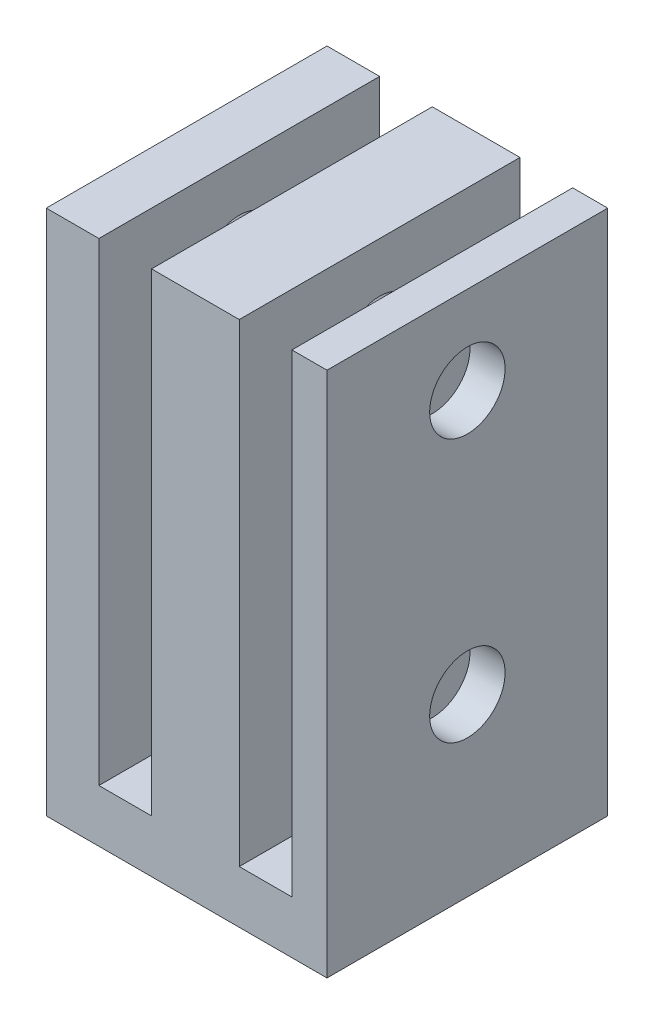
ISO-10303-21;
HEADER;
FILE_DESCRIPTION(('STEP AP214'),'2;1');
FILE_NAME('part.step','',(''),(''),'','','');
FILE_SCHEMA(('AUTOMOTIVE_DESIGN { 1 0 10303 214 1 1 1 1 }'));
ENDSEC;
DATA;
#1=APPLICATION_CONTEXT('core data for automotive mechanical design processes');
#2=APPLICATION_PROTOCOL_DEFINITION('international standard','automotive_design',2000,#1);
#3=PRODUCT_CONTEXT('',#1,'mechanical');
#4=PRODUCT('Part','Part','',(#3));
#5=PRODUCT_RELATED_PRODUCT_CATEGORY('part','',(#4));
#6=PRODUCT_DEFINITION_FORMATION('','',#4);
#7=PRODUCT_DEFINITION_CONTEXT('part definition',#1,'design');
#8=PRODUCT_DEFINITION('design','',#6,#7);
#9=PRODUCT_DEFINITION_SHAPE('','',#8);
#10=(LENGTH_UNIT() NAMED_UNIT(*) SI_UNIT(.MILLI.,.METRE.));
#11=(NAMED_UNIT(*) PLANE_ANGLE_UNIT() SI_UNIT($,.RADIAN.));
#12=(NAMED_UNIT(*) SI_UNIT($,.STERADIAN.) SOLID_ANGLE_UNIT());
#13=UNCERTAINTY_MEASURE_WITH_UNIT(LENGTH_MEASURE(1.E-05),#10,'distance_accuracy_value','');
#14=(GEOMETRIC_REPRESENTATION_CONTEXT(3) GLOBAL_UNCERTAINTY_ASSIGNED_CONTEXT((#13)) GLOBAL_UNIT_ASSIGNED_CONTEXT((#10,
#11,#12)) REPRESENTATION_CONTEXT('',''));
#15=CARTESIAN_POINT('',(0.,0.,0.));
#16=DIRECTION('',(0.,0.,1.));
#17=DIRECTION('',(1.,0.,0.));
#18=AXIS2_PLACEMENT_3D('',#15,#16,#17);
#19=CARTESIAN_POINT('',(0.,30.,0.));
#20=DIRECTION('',(0.,-1.,0.));
#21=DIRECTION('',(0.,0.,-1.));
#22=AXIS2_PLACEMENT_3D('',#19,#20,#21);
#23=PLANE('',#22);
#24=DIRECTION('',(1.,0.,0.));
#25=VECTOR('',#24,1.);
#26=CARTESIAN_POINT('',(0.,30.,0.));
#27=LINE('',#26,#25);
#28=CARTESIAN_POINT('',(0.,30.,0.));
#29=VERTEX_POINT('',#28);
#30=CARTESIAN_POINT('',(3.,30.,0.));
#31=VERTEX_POINT('',#30);
#32=EDGE_CURVE('E195',#29,#31,#27,.T.);
#33=ORIENTED_EDGE('',*,*,#32,.T.);
#34=DIRECTION('',(0.,0.,1.));
#35=VECTOR('',#34,1.);
#36=CARTESIAN_POINT('',(3.,30.,-16.));
#37=LINE('',#36,#35);
#38=CARTESIAN_POINT('',(3.,30.,-16.));
#39=VERTEX_POINT('',#38);
#40=EDGE_CURVE('E161',#39,#31,#37,.T.);
#41=ORIENTED_EDGE('',*,*,#40,.F.);
#42=DIRECTION('',(-1.,0.,0.));
#43=VECTOR('',#42,1.);
#44=CARTESIAN_POINT('',(0.,30.,-16.));
#45=LINE('',#44,#43);
#46=CARTESIAN_POINT('',(0.,30.,-16.));
#47=VERTEX_POINT('',#46);
#48=EDGE_CURVE('E149',#39,#47,#45,.T.);
#49=ORIENTED_EDGE('',*,*,#48,.T.);
#50=DIRECTION('',(0.,0.,1.));
#51=VECTOR('',#50,1.);
#52=CARTESIAN_POINT('',(0.,30.,0.));
#53=LINE('',#52,#51);
#54=EDGE_CURVE('E190',#47,#29,#53,.T.);
#55=ORIENTED_EDGE('',*,*,#54,.T.);
#56=EDGE_LOOP('',(#33,#41,#49,#55));
#57=FACE_BOUND('',#56,.T.);
#58=ADVANCED_FACE('F35',(#57),#23,.F.);
#59=CARTESIAN_POINT('',(11.,30.,-16.));
#60=VERTEX_POINT('',#59);
#61=CARTESIAN_POINT('',(6.,30.,-16.));
#62=VERTEX_POINT('',#61);
#63=EDGE_CURVE('E205',#60,#62,#45,.T.);
#64=ORIENTED_EDGE('',*,*,#63,.T.);
#65=DIRECTION('',(0.,0.,1.));
#66=VECTOR('',#65,1.);
#67=CARTESIAN_POINT('',(6.,30.,-16.));
#68=LINE('',#67,#66);
#69=CARTESIAN_POINT('',(6.,30.,0.));
#70=VERTEX_POINT('',#69);
#71=EDGE_CURVE('E164',#62,#70,#68,.T.);
#72=ORIENTED_EDGE('',*,*,#71,.T.);
#73=CARTESIAN_POINT('',(11.,30.,0.));
#74=VERTEX_POINT('',#73);
#75=EDGE_CURVE('E199',#70,#74,#27,.T.);
#76=ORIENTED_EDGE('',*,*,#75,.T.);
#77=DIRECTION('',(0.,0.,1.));
#78=VECTOR('',#77,1.);
#79=CARTESIAN_POINT('',(11.,30.,-16.));
#80=LINE('',#79,#78);
#81=EDGE_CURVE('E159',#60,#74,#80,.T.);
#82=ORIENTED_EDGE('',*,*,#81,.F.);
#83=EDGE_LOOP('',(#64,#72,#76,#82));
#84=FACE_BOUND('',#83,.T.);
#85=ADVANCED_FACE('F281',(#84),#23,.F.);
#86=CARTESIAN_POINT('',(0.,30.,0.));
#87=DIRECTION('',(1.,0.,0.));
#88=DIRECTION('',(0.,0.,-1.));
#89=AXIS2_PLACEMENT_3D('',#86,#87,#88);
#90=PLANE('',#89);
#91=CARTESIAN_POINT('',(0.,25.,-8.));
#92=DIRECTION('',(-1.,0.,0.));
#93=DIRECTION('',(0.,0.,1.));
#94=AXIS2_PLACEMENT_3D('',#91,#92,#93);
#95=CIRCLE('',#94,2.15);
#96=CARTESIAN_POINT('',(0.,25.,-5.85));
#97=VERTEX_POINT('',#96);
#98=EDGE_CURVE('E229',#97,#97,#95,.T.);
#99=ORIENTED_EDGE('',*,*,#98,.F.);
#100=EDGE_LOOP('',(#99));
#101=FACE_BOUND('',#100,.T.);
#102=CARTESIAN_POINT('',(0.,10.,-8.));
#103=DIRECTION('',(-1.,0.,0.));
#104=DIRECTION('',(0.,0.,1.));
#105=AXIS2_PLACEMENT_3D('',#102,#103,#104);
#106=CIRCLE('',#105,2.15);
#107=CARTESIAN_POINT('',(0.,10.,-5.85));
#108=VERTEX_POINT('',#107);
#109=EDGE_CURVE('E239',#108,#108,#106,.T.);
#110=ORIENTED_EDGE('',*,*,#109,.F.);
#111=EDGE_LOOP('',(#110));
#112=FACE_BOUND('',#111,.T.);
#113=DIRECTION('',(0.,0.,1.));
#114=VECTOR('',#113,1.);
#115=CARTESIAN_POINT('',(0.,0.,0.));
#116=LINE('',#115,#114);
#117=CARTESIAN_POINT('',(0.,0.,-16.));
#118=VERTEX_POINT('',#117);
#119=CARTESIAN_POINT('',(0.,0.,0.));
#120=VERTEX_POINT('',#119);
#121=EDGE_CURVE('E163',#118,#120,#116,.T.);
#122=ORIENTED_EDGE('',*,*,#121,.T.);
#123=DIRECTION('',(0.,-1.,0.));
#124=VECTOR('',#123,1.);
#125=CARTESIAN_POINT('',(0.,30.,0.));
#126=LINE('',#125,#124);
#127=EDGE_CURVE('E11',#29,#120,#126,.T.);
#128=ORIENTED_EDGE('',*,*,#127,.F.);
#129=ORIENTED_EDGE('',*,*,#54,.F.);
#130=DIRECTION('',(0.,-1.,0.));
#131=VECTOR('',#130,1.);
#132=CARTESIAN_POINT('',(0.,30.,-16.));
#133=LINE('',#132,#131);
#134=EDGE_CURVE('E204',#47,#118,#133,.T.);
#135=ORIENTED_EDGE('',*,*,#134,.T.);
#136=EDGE_LOOP('',(#122,#128,#129,#135));
#137=FACE_BOUND('',#136,.T.);
#138=ADVANCED_FACE('F37',(#101,#112,#137),#90,.F.);
#139=CARTESIAN_POINT('',(0.,30.,0.));
#140=DIRECTION('',(0.,0.,-1.));
#141=DIRECTION('',(-1.,0.,0.));
#142=AXIS2_PLACEMENT_3D('',#139,#140,#141);
#143=PLANE('',#142);
#144=DIRECTION('',(1.,0.,0.));
#145=VECTOR('',#144,1.);
#146=CARTESIAN_POINT('',(3.,3.,0.));
#147=LINE('',#146,#145);
#148=CARTESIAN_POINT('',(3.,3.,0.));
#149=VERTEX_POINT('',#148);
#150=CARTESIAN_POINT('',(6.,3.,0.));
#151=VERTEX_POINT('',#150);
#152=EDGE_CURVE('E151',#149,#151,#147,.T.);
#153=ORIENTED_EDGE('',*,*,#152,.F.);
#154=DIRECTION('',(0.,-1.,0.));
#155=VECTOR('',#154,1.);
#156=CARTESIAN_POINT('',(3.,30.,0.));
#157=LINE('',#156,#155);
#158=EDGE_CURVE('E132',#31,#149,#157,.T.);
#159=ORIENTED_EDGE('',*,*,#158,.F.);
#160=ORIENTED_EDGE('',*,*,#32,.F.);
#161=ORIENTED_EDGE('',*,*,#127,.T.);
#162=DIRECTION('',(1.,0.,0.));
#163=VECTOR('',#162,1.);
#164=CARTESIAN_POINT('',(0.,0.,0.));
#165=LINE('',#164,#163);
#166=CARTESIAN_POINT('',(16.,0.,0.));
#167=VERTEX_POINT('',#166);
#168=EDGE_CURVE('E208',#120,#167,#165,.T.);
#169=ORIENTED_EDGE('',*,*,#168,.T.);
#170=DIRECTION('',(0.,-1.,0.));
#171=VECTOR('',#170,1.);
#172=CARTESIAN_POINT('',(16.,30.,0.));
#173=LINE('',#172,#171);
#174=CARTESIAN_POINT('',(16.,30.,0.));
#175=VERTEX_POINT('',#174);
#176=EDGE_CURVE('E44',#175,#167,#173,.T.);
#177=ORIENTED_EDGE('',*,*,#176,.F.);
#178=CARTESIAN_POINT('',(14.,30.,0.));
#179=VERTEX_POINT('',#178);
#180=EDGE_CURVE('E193',#179,#175,#27,.T.);
#181=ORIENTED_EDGE('',*,*,#180,.F.);
#182=DIRECTION('',(0.,1.,0.));
#183=VECTOR('',#182,1.);
#184=CARTESIAN_POINT('',(14.,30.,0.));
#185=LINE('',#184,#183);
#186=CARTESIAN_POINT('',(14.,3.,0.));
#187=VERTEX_POINT('',#186);
#188=EDGE_CURVE('E52',#187,#179,#185,.T.);
#189=ORIENTED_EDGE('',*,*,#188,.F.);
#190=DIRECTION('',(1.,0.,0.));
#191=VECTOR('',#190,1.);
#192=CARTESIAN_POINT('',(11.,3.,0.));
#193=LINE('',#192,#191);
#194=CARTESIAN_POINT('',(11.,3.,0.));
#195=VERTEX_POINT('',#194);
#196=EDGE_CURVE('E180',#195,#187,#193,.T.);
#197=ORIENTED_EDGE('',*,*,#196,.F.);
#198=DIRECTION('',(0.,-1.,0.));
#199=VECTOR('',#198,1.);
#200=CARTESIAN_POINT('',(11.,30.,0.));
#201=LINE('',#200,#199);
#202=EDGE_CURVE('E177',#74,#195,#201,.T.);
#203=ORIENTED_EDGE('',*,*,#202,.F.);
#204=ORIENTED_EDGE('',*,*,#75,.F.);
#205=DIRECTION('',(0.,1.,0.));
#206=VECTOR('',#205,1.);
#207=CARTESIAN_POINT('',(6.,30.,0.));
#208=LINE('',#207,#206);
#209=EDGE_CURVE('E60',#151,#70,#208,.T.);
#210=ORIENTED_EDGE('',*,*,#209,.F.);
#211=EDGE_LOOP('',(#153,#159,#160,#161,#169,#177,#181,#189,#197,#203,#204,#210));
#212=FACE_BOUND('',#211,.T.);
#213=ADVANCED_FACE('F314',(#212),#143,.F.);
#214=CARTESIAN_POINT('',(16.,30.,0.));
#215=DIRECTION('',(-1.,0.,0.));
#216=DIRECTION('',(0.,0.,1.));
#217=AXIS2_PLACEMENT_3D('',#214,#215,#216);
#218=PLANE('',#217);
#219=CARTESIAN_POINT('',(16.,25.,-8.));
#220=DIRECTION('',(-1.,0.,0.));
#221=DIRECTION('',(0.,0.,1.));
#222=AXIS2_PLACEMENT_3D('',#219,#220,#221);
#223=CIRCLE('',#222,2.15);
#224=CARTESIAN_POINT('',(16.,25.,-5.85));
#225=VERTEX_POINT('',#224);
#226=EDGE_CURVE('E222',#225,#225,#223,.T.);
#227=ORIENTED_EDGE('',*,*,#226,.T.);
#228=EDGE_LOOP('',(#227));
#229=FACE_BOUND('',#228,.T.);
#230=CARTESIAN_POINT('',(16.,10.,-8.));
#231=DIRECTION('',(-1.,0.,0.));
#232=DIRECTION('',(0.,0.,1.));
#233=AXIS2_PLACEMENT_3D('',#230,#231,#232);
#234=CIRCLE('',#233,2.15);
#235=CARTESIAN_POINT('',(16.,10.,-5.85));
#236=VERTEX_POINT('',#235);
#237=EDGE_CURVE('E234',#236,#236,#234,.T.);
#238=ORIENTED_EDGE('',*,*,#237,.T.);
#239=EDGE_LOOP('',(#238));
#240=FACE_BOUND('',#239,.T.);
#241=DIRECTION('',(0.,0.,-1.));
#242=VECTOR('',#241,1.);
#243=CARTESIAN_POINT('',(16.,0.,0.));
#244=LINE('',#243,#242);
#245=CARTESIAN_POINT('',(16.,0.,-16.));
#246=VERTEX_POINT('',#245);
#247=EDGE_CURVE('E210',#167,#246,#244,.T.);
#248=ORIENTED_EDGE('',*,*,#247,.T.);
#249=DIRECTION('',(0.,-1.,0.));
#250=VECTOR('',#249,1.);
#251=CARTESIAN_POINT('',(16.,30.,-16.));
#252=LINE('',#251,#250);
#253=CARTESIAN_POINT('',(16.,30.,-16.));
#254=VERTEX_POINT('',#253);
#255=EDGE_CURVE('E215',#254,#246,#252,.T.);
#256=ORIENTED_EDGE('',*,*,#255,.F.);
#257=DIRECTION('',(0.,0.,-1.));
#258=VECTOR('',#257,1.);
#259=CARTESIAN_POINT('',(16.,30.,0.));
#260=LINE('',#259,#258);
#261=EDGE_CURVE('E198',#175,#254,#260,.T.);
#262=ORIENTED_EDGE('',*,*,#261,.F.);
#263=ORIENTED_EDGE('',*,*,#176,.T.);
#264=EDGE_LOOP('',(#248,#256,#262,#263));
#265=FACE_BOUND('',#264,.T.);
#266=ADVANCED_FACE('F299',(#229,#240,#265),#218,.F.);
#267=CARTESIAN_POINT('',(0.,30.,-16.));
#268=DIRECTION('',(0.,0.,1.));
#269=DIRECTION('',(1.,0.,0.));
#270=AXIS2_PLACEMENT_3D('',#267,#268,#269);
#271=PLANE('',#270);
#272=ORIENTED_EDGE('',*,*,#48,.F.);
#273=DIRECTION('',(0.,-1.,0.));
#274=VECTOR('',#273,1.);
#275=CARTESIAN_POINT('',(3.,30.,-16.));
#276=LINE('',#275,#274);
#277=CARTESIAN_POINT('',(3.,3.,-16.));
#278=VERTEX_POINT('',#277);
#279=EDGE_CURVE('E129',#39,#278,#276,.T.);
#280=ORIENTED_EDGE('',*,*,#279,.T.);
#281=DIRECTION('',(1.,0.,0.));
#282=VECTOR('',#281,1.);
#283=CARTESIAN_POINT('',(3.,3.,-16.));
#284=LINE('',#283,#282);
#285=CARTESIAN_POINT('',(6.,3.,-16.));
#286=VERTEX_POINT('',#285);
#287=EDGE_CURVE('E140',#278,#286,#284,.T.);
#288=ORIENTED_EDGE('',*,*,#287,.T.);
#289=DIRECTION('',(0.,1.,0.));
#290=VECTOR('',#289,1.);
#291=CARTESIAN_POINT('',(6.,30.,-16.));
#292=LINE('',#291,#290);
#293=EDGE_CURVE('E137',#286,#62,#292,.T.);
#294=ORIENTED_EDGE('',*,*,#293,.T.);
#295=ORIENTED_EDGE('',*,*,#63,.F.);
#296=DIRECTION('',(0.,-1.,0.));
#297=VECTOR('',#296,1.);
#298=CARTESIAN_POINT('',(11.,30.,-16.));
#299=LINE('',#298,#297);
#300=CARTESIAN_POINT('',(11.,3.,-16.));
#301=VERTEX_POINT('',#300);
#302=EDGE_CURVE('E167',#60,#301,#299,.T.);
#303=ORIENTED_EDGE('',*,*,#302,.T.);
#304=DIRECTION('',(1.,0.,0.));
#305=VECTOR('',#304,1.);
#306=CARTESIAN_POINT('',(11.,3.,-16.));
#307=LINE('',#306,#305);
#308=CARTESIAN_POINT('',(14.,3.,-16.));
#309=VERTEX_POINT('',#308);
#310=EDGE_CURVE('E170',#301,#309,#307,.T.);
#311=ORIENTED_EDGE('',*,*,#310,.T.);
#312=DIRECTION('',(0.,1.,0.));
#313=VECTOR('',#312,1.);
#314=CARTESIAN_POINT('',(14.,30.,-16.));
#315=LINE('',#314,#313);
#316=CARTESIAN_POINT('',(14.,30.,-16.));
#317=VERTEX_POINT('',#316);
#318=EDGE_CURVE('E173',#309,#317,#315,.T.);
#319=ORIENTED_EDGE('',*,*,#318,.T.);
#320=EDGE_CURVE('E201',#254,#317,#45,.T.);
#321=ORIENTED_EDGE('',*,*,#320,.F.);
#322=ORIENTED_EDGE('',*,*,#255,.T.);
#323=DIRECTION('',(-1.,0.,0.));
#324=VECTOR('',#323,1.);
#325=CARTESIAN_POINT('',(0.,0.,-16.));
#326=LINE('',#325,#324);
#327=EDGE_CURVE('E194',#246,#118,#326,.T.);
#328=ORIENTED_EDGE('',*,*,#327,.T.);
#329=ORIENTED_EDGE('',*,*,#134,.F.);
#330=EDGE_LOOP('',(#272,#280,#288,#294,#295,#303,#311,#319,#321,#322,#328,#329));
#331=FACE_BOUND('',#330,.T.);
#332=ADVANCED_FACE('F147',(#331),#271,.F.);
#333=ORIENTED_EDGE('',*,*,#320,.T.);
#334=DIRECTION('',(0.,0.,1.));
#335=VECTOR('',#334,1.);
#336=CARTESIAN_POINT('',(14.,30.,-16.));
#337=LINE('',#336,#335);
#338=EDGE_CURVE('E185',#317,#179,#337,.T.);
#339=ORIENTED_EDGE('',*,*,#338,.T.);
#340=ORIENTED_EDGE('',*,*,#180,.T.);
#341=ORIENTED_EDGE('',*,*,#261,.T.);
#342=EDGE_LOOP('',(#333,#339,#340,#341));
#343=FACE_BOUND('',#342,.T.);
#344=ADVANCED_FACE('F284',(#343),#23,.F.);
#345=CARTESIAN_POINT('',(0.,0.,0.));
#346=DIRECTION('',(0.,-1.,0.));
#347=DIRECTION('',(0.,0.,-1.));
#348=AXIS2_PLACEMENT_3D('',#345,#346,#347);
#349=PLANE('',#348);
#350=ORIENTED_EDGE('',*,*,#121,.F.);
#351=ORIENTED_EDGE('',*,*,#327,.F.);
#352=ORIENTED_EDGE('',*,*,#247,.F.);
#353=ORIENTED_EDGE('',*,*,#168,.F.);
#354=EDGE_LOOP('',(#350,#351,#352,#353));
#355=FACE_BOUND('',#354,.T.);
#356=ADVANCED_FACE('F292',(#355),#349,.T.);
#357=CARTESIAN_POINT('',(11.,30.,-16.));
#358=DIRECTION('',(-1.,0.,0.));
#359=DIRECTION('',(0.,-1.,0.));
#360=AXIS2_PLACEMENT_3D('',#357,#358,#359);
#361=PLANE('',#360);
#362=CARTESIAN_POINT('',(11.,25.,-8.));
#363=DIRECTION('',(-1.,0.,0.));
#364=DIRECTION('',(0.,-1.,0.));
#365=AXIS2_PLACEMENT_3D('',#362,#363,#364);
#366=CIRCLE('',#365,2.15);
#367=CARTESIAN_POINT('',(11.,22.85,-8.));
#368=VERTEX_POINT('',#367);
#369=EDGE_CURVE('E154',#368,#368,#366,.T.);
#370=ORIENTED_EDGE('',*,*,#369,.T.);
#371=EDGE_LOOP('',(#370));
#372=FACE_BOUND('',#371,.T.);
#373=CARTESIAN_POINT('',(11.,10.,-8.));
#374=DIRECTION('',(-1.,0.,0.));
#375=DIRECTION('',(0.,-1.,0.));
#376=AXIS2_PLACEMENT_3D('',#373,#374,#375);
#377=CIRCLE('',#376,2.15);
#378=CARTESIAN_POINT('',(11.,7.85,-8.));
#379=VERTEX_POINT('',#378);
#380=EDGE_CURVE('E244',#379,#379,#377,.T.);
#381=ORIENTED_EDGE('',*,*,#380,.T.);
#382=EDGE_LOOP('',(#381));
#383=FACE_BOUND('',#382,.T.);
#384=ORIENTED_EDGE('',*,*,#202,.T.);
#385=DIRECTION('',(0.,0.,1.));
#386=VECTOR('',#385,1.);
#387=CARTESIAN_POINT('',(11.,3.,-16.));
#388=LINE('',#387,#386);
#389=EDGE_CURVE('E176',#301,#195,#388,.T.);
#390=ORIENTED_EDGE('',*,*,#389,.F.);
#391=ORIENTED_EDGE('',*,*,#302,.F.);
#392=ORIENTED_EDGE('',*,*,#81,.T.);
#393=EDGE_LOOP('',(#384,#390,#391,#392));
#394=FACE_BOUND('',#393,.T.);
#395=ADVANCED_FACE('F256',(#372,#383,#394),#361,.F.);
#396=CARTESIAN_POINT('',(14.,30.,-16.));
#397=DIRECTION('',(1.,0.,0.));
#398=DIRECTION('',(0.,1.,0.));
#399=AXIS2_PLACEMENT_3D('',#396,#397,#398);
#400=PLANE('',#399);
#401=CARTESIAN_POINT('',(14.,25.,-8.));
#402=DIRECTION('',(1.,0.,0.));
#403=DIRECTION('',(0.,1.,0.));
#404=AXIS2_PLACEMENT_3D('',#401,#402,#403);
#405=CIRCLE('',#404,2.15);
#406=CARTESIAN_POINT('',(14.,27.15,-8.));
#407=VERTEX_POINT('',#406);
#408=EDGE_CURVE('E249',#407,#407,#405,.T.);
#409=ORIENTED_EDGE('',*,*,#408,.T.);
#410=EDGE_LOOP('',(#409));
#411=FACE_BOUND('',#410,.T.);
#412=CARTESIAN_POINT('',(14.,10.,-8.));
#413=DIRECTION('',(1.,0.,0.));
#414=DIRECTION('',(0.,1.,0.));
#415=AXIS2_PLACEMENT_3D('',#412,#413,#414);
#416=CIRCLE('',#415,2.15);
#417=CARTESIAN_POINT('',(14.,12.15,-8.));
#418=VERTEX_POINT('',#417);
#419=EDGE_CURVE('E226',#418,#418,#416,.T.);
#420=ORIENTED_EDGE('',*,*,#419,.T.);
#421=EDGE_LOOP('',(#420));
#422=FACE_BOUND('',#421,.T.);
#423=ORIENTED_EDGE('',*,*,#188,.T.);
#424=ORIENTED_EDGE('',*,*,#338,.F.);
#425=ORIENTED_EDGE('',*,*,#318,.F.);
#426=DIRECTION('',(0.,0.,1.));
#427=VECTOR('',#426,1.);
#428=CARTESIAN_POINT('',(14.,3.,-16.));
#429=LINE('',#428,#427);
#430=EDGE_CURVE('E187',#309,#187,#429,.T.);
#431=ORIENTED_EDGE('',*,*,#430,.T.);
#432=EDGE_LOOP('',(#423,#424,#425,#431));
#433=FACE_BOUND('',#432,.T.);
#434=ADVANCED_FACE('F308',(#411,#422,#433),#400,.F.);
#435=CARTESIAN_POINT('',(11.,3.,-16.));
#436=DIRECTION('',(0.,-1.,0.));
#437=DIRECTION('',(0.,0.,-1.));
#438=AXIS2_PLACEMENT_3D('',#435,#436,#437);
#439=PLANE('',#438);
#440=ORIENTED_EDGE('',*,*,#196,.T.);
#441=ORIENTED_EDGE('',*,*,#430,.F.);
#442=ORIENTED_EDGE('',*,*,#310,.F.);
#443=ORIENTED_EDGE('',*,*,#389,.T.);
#444=EDGE_LOOP('',(#440,#441,#442,#443));
#445=FACE_BOUND('',#444,.T.);
#446=ADVANCED_FACE('F311',(#445),#439,.F.);
#447=CARTESIAN_POINT('',(3.,30.,-16.));
#448=DIRECTION('',(-1.,0.,0.));
#449=DIRECTION('',(0.,-1.,0.));
#450=AXIS2_PLACEMENT_3D('',#447,#448,#449);
#451=PLANE('',#450);
#452=CARTESIAN_POINT('',(3.,25.,-8.));
#453=DIRECTION('',(-1.,0.,0.));
#454=DIRECTION('',(0.,-1.,0.));
#455=AXIS2_PLACEMENT_3D('',#452,#453,#454);
#456=CIRCLE('',#455,2.15);
#457=CARTESIAN_POINT('',(3.,22.85,-8.));
#458=VERTEX_POINT('',#457);
#459=EDGE_CURVE('E247',#458,#458,#456,.T.);
#460=ORIENTED_EDGE('',*,*,#459,.T.);
#461=EDGE_LOOP('',(#460));
#462=FACE_BOUND('',#461,.T.);
#463=CARTESIAN_POINT('',(3.,10.,-8.));
#464=DIRECTION('',(-1.,0.,0.));
#465=DIRECTION('',(0.,-1.,0.));
#466=AXIS2_PLACEMENT_3D('',#463,#464,#465);
#467=CIRCLE('',#466,2.15);
#468=CARTESIAN_POINT('',(3.,7.85,-8.));
#469=VERTEX_POINT('',#468);
#470=EDGE_CURVE('E221',#469,#469,#467,.T.);
#471=ORIENTED_EDGE('',*,*,#470,.T.);
#472=EDGE_LOOP('',(#471));
#473=FACE_BOUND('',#472,.T.);
#474=ORIENTED_EDGE('',*,*,#158,.T.);
#475=DIRECTION('',(0.,0.,1.));
#476=VECTOR('',#475,1.);
#477=CARTESIAN_POINT('',(3.,3.,-16.));
#478=LINE('',#477,#476);
#479=EDGE_CURVE('E125',#278,#149,#478,.T.);
#480=ORIENTED_EDGE('',*,*,#479,.F.);
#481=ORIENTED_EDGE('',*,*,#279,.F.);
#482=ORIENTED_EDGE('',*,*,#40,.T.);
#483=EDGE_LOOP('',(#474,#480,#481,#482));
#484=FACE_BOUND('',#483,.T.);
#485=ADVANCED_FACE('F127',(#462,#473,#484),#451,.F.);
#486=CARTESIAN_POINT('',(6.,30.,-16.));
#487=DIRECTION('',(1.,0.,0.));
#488=DIRECTION('',(0.,1.,0.));
#489=AXIS2_PLACEMENT_3D('',#486,#487,#488);
#490=PLANE('',#489);
#491=CARTESIAN_POINT('',(6.,25.,-8.));
#492=DIRECTION('',(1.,0.,0.));
#493=DIRECTION('',(0.,1.,0.));
#494=AXIS2_PLACEMENT_3D('',#491,#492,#493);
#495=CIRCLE('',#494,2.15);
#496=CARTESIAN_POINT('',(6.,27.15,-8.));
#497=VERTEX_POINT('',#496);
#498=EDGE_CURVE('E39',#497,#497,#495,.T.);
#499=ORIENTED_EDGE('',*,*,#498,.T.);
#500=EDGE_LOOP('',(#499));
#501=FACE_BOUND('',#500,.T.);
#502=CARTESIAN_POINT('',(6.,10.,-8.));
#503=DIRECTION('',(1.,0.,0.));
#504=DIRECTION('',(0.,1.,0.));
#505=AXIS2_PLACEMENT_3D('',#502,#503,#504);
#506=CIRCLE('',#505,2.15);
#507=CARTESIAN_POINT('',(6.,12.15,-8.));
#508=VERTEX_POINT('',#507);
#509=EDGE_CURVE('E219',#508,#508,#506,.T.);
#510=ORIENTED_EDGE('',*,*,#509,.T.);
#511=EDGE_LOOP('',(#510));
#512=FACE_BOUND('',#511,.T.);
#513=ORIENTED_EDGE('',*,*,#209,.T.);
#514=ORIENTED_EDGE('',*,*,#71,.F.);
#515=ORIENTED_EDGE('',*,*,#293,.F.);
#516=DIRECTION('',(0.,0.,1.));
#517=VECTOR('',#516,1.);
#518=CARTESIAN_POINT('',(6.,3.,-16.));
#519=LINE('',#518,#517);
#520=EDGE_CURVE('E136',#286,#151,#519,.T.);
#521=ORIENTED_EDGE('',*,*,#520,.T.);
#522=EDGE_LOOP('',(#513,#514,#515,#521));
#523=FACE_BOUND('',#522,.T.);
#524=ADVANCED_FACE('F350',(#501,#512,#523),#490,.F.);
#525=CARTESIAN_POINT('',(3.,3.,-16.));
#526=DIRECTION('',(0.,-1.,0.));
#527=DIRECTION('',(1.,0.,0.));
#528=AXIS2_PLACEMENT_3D('',#525,#526,#527);
#529=PLANE('',#528);
#530=ORIENTED_EDGE('',*,*,#152,.T.);
#531=ORIENTED_EDGE('',*,*,#520,.F.);
#532=ORIENTED_EDGE('',*,*,#287,.F.);
#533=ORIENTED_EDGE('',*,*,#479,.T.);
#534=EDGE_LOOP('',(#530,#531,#532,#533));
#535=FACE_BOUND('',#534,.T.);
#536=ADVANCED_FACE('F141',(#535),#529,.F.);
#537=CARTESIAN_POINT('',(16.,10.,-8.));
#538=DIRECTION('',(-1.,0.,0.));
#539=DIRECTION('',(0.,0.,1.));
#540=AXIS2_PLACEMENT_3D('',#537,#538,#539);
#541=CYLINDRICAL_SURFACE('',#540,2.15);
#542=ORIENTED_EDGE('',*,*,#509,.F.);
#543=EDGE_LOOP('',(#542));
#544=FACE_BOUND('',#543,.T.);
#545=ORIENTED_EDGE('',*,*,#380,.F.);
#546=EDGE_LOOP('',(#545));
#547=FACE_BOUND('',#546,.T.);
#548=ADVANCED_FACE('F262',(#544,#547),#541,.F.);
#549=CARTESIAN_POINT('',(16.,25.,-8.));
#550=DIRECTION('',(-1.,0.,0.));
#551=DIRECTION('',(0.,0.,1.));
#552=AXIS2_PLACEMENT_3D('',#549,#550,#551);
#553=CYLINDRICAL_SURFACE('',#552,2.15);
#554=ORIENTED_EDGE('',*,*,#498,.F.);
#555=EDGE_LOOP('',(#554));
#556=FACE_BOUND('',#555,.T.);
#557=ORIENTED_EDGE('',*,*,#369,.F.);
#558=EDGE_LOOP('',(#557));
#559=FACE_BOUND('',#558,.T.);
#560=ADVANCED_FACE('F259',(#556,#559),#553,.F.);
#561=ORIENTED_EDGE('',*,*,#109,.T.);
#562=EDGE_LOOP('',(#561));
#563=FACE_BOUND('',#562,.T.);
#564=ORIENTED_EDGE('',*,*,#470,.F.);
#565=EDGE_LOOP('',(#564));
#566=FACE_BOUND('',#565,.T.);
#567=ADVANCED_FACE('F261',(#563,#566),#541,.F.);
#568=ORIENTED_EDGE('',*,*,#98,.T.);
#569=EDGE_LOOP('',(#568));
#570=FACE_BOUND('',#569,.T.);
#571=ORIENTED_EDGE('',*,*,#459,.F.);
#572=EDGE_LOOP('',(#571));
#573=FACE_BOUND('',#572,.T.);
#574=ADVANCED_FACE('F266',(#570,#573),#553,.F.);
#575=ORIENTED_EDGE('',*,*,#237,.F.);
#576=EDGE_LOOP('',(#575));
#577=FACE_BOUND('',#576,.T.);
#578=ORIENTED_EDGE('',*,*,#419,.F.);
#579=EDGE_LOOP('',(#578));
#580=FACE_BOUND('',#579,.T.);
#581=ADVANCED_FACE('F273',(#577,#580),#541,.F.);
#582=ORIENTED_EDGE('',*,*,#226,.F.);
#583=EDGE_LOOP('',(#582));
#584=FACE_BOUND('',#583,.T.);
#585=ORIENTED_EDGE('',*,*,#408,.F.);
#586=EDGE_LOOP('',(#585));
#587=FACE_BOUND('',#586,.T.);
#588=ADVANCED_FACE('F265',(#584,#587),#553,.F.);
#589=CLOSED_SHELL('',(#58,#85,#138,#213,#266,#332,#344,#356,#395,#434,#446,#485,#524,#536,#548,
#560,#567,#574,#581,#588));
#590=MANIFOLD_SOLID_BREP('B2',#589);
#591=ADVANCED_BREP_SHAPE_REPRESENTATION('',(#18,#590),#14);
#592=SHAPE_DEFINITION_REPRESENTATION(#9,#591);
ENDSEC;
END-ISO-10303-21;
